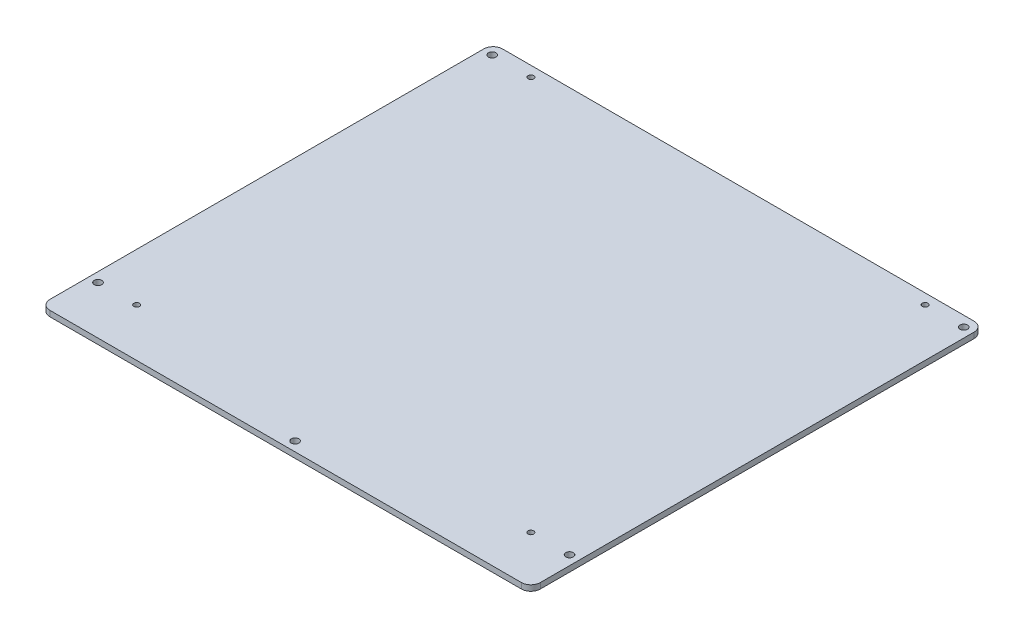
ISO-10303-21;
HEADER;
FILE_DESCRIPTION(('STEP AP214'),'2;1');
FILE_NAME('part.step','',(''),(''),'','','');
FILE_SCHEMA(('AUTOMOTIVE_DESIGN { 1 0 10303 214 1 1 1 1 }'));
ENDSEC;
DATA;
#1=APPLICATION_CONTEXT('core data for automotive mechanical design processes');
#2=APPLICATION_PROTOCOL_DEFINITION('international standard','automotive_design',2000,#1);
#3=PRODUCT_CONTEXT('',#1,'mechanical');
#4=PRODUCT('Part','Part','',(#3));
#5=PRODUCT_RELATED_PRODUCT_CATEGORY('part','',(#4));
#6=PRODUCT_DEFINITION_FORMATION('','',#4);
#7=PRODUCT_DEFINITION_CONTEXT('part definition',#1,'design');
#8=PRODUCT_DEFINITION('design','',#6,#7);
#9=PRODUCT_DEFINITION_SHAPE('','',#8);
#10=(LENGTH_UNIT() NAMED_UNIT(*) SI_UNIT(.MILLI.,.METRE.));
#11=(NAMED_UNIT(*) PLANE_ANGLE_UNIT() SI_UNIT($,.RADIAN.));
#12=(NAMED_UNIT(*) SI_UNIT($,.STERADIAN.) SOLID_ANGLE_UNIT());
#13=UNCERTAINTY_MEASURE_WITH_UNIT(LENGTH_MEASURE(1.E-05),#10,'distance_accuracy_value','');
#14=(GEOMETRIC_REPRESENTATION_CONTEXT(3) GLOBAL_UNCERTAINTY_ASSIGNED_CONTEXT((#13)) GLOBAL_UNIT_ASSIGNED_CONTEXT((#10,
#11,#12)) REPRESENTATION_CONTEXT('',''));
#15=CARTESIAN_POINT('',(0.,0.,0.));
#16=DIRECTION('',(0.,0.,1.));
#17=DIRECTION('',(1.,0.,0.));
#18=AXIS2_PLACEMENT_3D('',#15,#16,#17);
#19=CARTESIAN_POINT('',(0.,3.,0.));
#20=DIRECTION('',(0.,1.,0.));
#21=DIRECTION('',(0.,0.,1.));
#22=AXIS2_PLACEMENT_3D('',#19,#20,#21);
#23=PLANE('',#22);
#24=CARTESIAN_POINT('',(-125.,3.,-104.5));
#25=DIRECTION('',(0.,1.,0.));
#26=DIRECTION('',(0.,0.,1.));
#27=AXIS2_PLACEMENT_3D('',#24,#25,#26);
#28=CIRCLE('',#27,2.);
#29=CARTESIAN_POINT('',(-125.,3.,-102.5));
#30=VERTEX_POINT('',#29);
#31=EDGE_CURVE('E215',#30,#30,#28,.T.);
#32=ORIENTED_EDGE('',*,*,#31,.F.);
#33=EDGE_LOOP('',(#32));
#34=FACE_BOUND('',#33,.T.);
#35=CARTESIAN_POINT('',(125.,3.,104.5));
#36=DIRECTION('',(0.,1.,0.));
#37=DIRECTION('',(0.,0.,1.));
#38=AXIS2_PLACEMENT_3D('',#35,#36,#37);
#39=CIRCLE('',#38,2.);
#40=CARTESIAN_POINT('',(125.,3.,106.5));
#41=VERTEX_POINT('',#40);
#42=EDGE_CURVE('E203',#41,#41,#39,.T.);
#43=ORIENTED_EDGE('',*,*,#42,.F.);
#44=EDGE_LOOP('',(#43));
#45=FACE_BOUND('',#44,.T.);
#46=CARTESIAN_POINT('',(104.5,3.,104.5));
#47=DIRECTION('',(0.,1.,0.));
#48=DIRECTION('',(0.,0.,1.));
#49=AXIS2_PLACEMENT_3D('',#46,#47,#48);
#50=CIRCLE('',#49,1.5);
#51=CARTESIAN_POINT('',(104.5,3.,106.));
#52=VERTEX_POINT('',#51);
#53=EDGE_CURVE('E191',#52,#52,#50,.T.);
#54=ORIENTED_EDGE('',*,*,#53,.F.);
#55=EDGE_LOOP('',(#54));
#56=FACE_BOUND('',#55,.T.);
#57=CARTESIAN_POINT('',(104.5,3.,-104.5));
#58=DIRECTION('',(0.,1.,0.));
#59=DIRECTION('',(0.,0.,1.));
#60=AXIS2_PLACEMENT_3D('',#57,#58,#59);
#61=CIRCLE('',#60,1.5);
#62=CARTESIAN_POINT('',(104.5,3.,-103.));
#63=VERTEX_POINT('',#62);
#64=EDGE_CURVE('E179',#63,#63,#61,.T.);
#65=ORIENTED_EDGE('',*,*,#64,.F.);
#66=EDGE_LOOP('',(#65));
#67=FACE_BOUND('',#66,.T.);
#68=DIRECTION('',(0.,0.,1.));
#69=VECTOR('',#68,1.);
#70=CARTESIAN_POINT('',(-130.,3.,-110.));
#71=LINE('',#70,#69);
#72=CARTESIAN_POINT('',(-130.,3.,-105.));
#73=VERTEX_POINT('',#72);
#74=CARTESIAN_POINT('',(-130.,3.,125.));
#75=VERTEX_POINT('',#74);
#76=EDGE_CURVE('E136',#73,#75,#71,.T.);
#77=ORIENTED_EDGE('',*,*,#76,.T.);
#78=CARTESIAN_POINT('',(-125.,3.,125.));
#79=DIRECTION('',(0.,1.,0.));
#80=DIRECTION('',(0.,0.,1.));
#81=AXIS2_PLACEMENT_3D('',#78,#79,#80);
#82=CIRCLE('',#81,5.);
#83=CARTESIAN_POINT('',(-125.,3.,130.));
#84=VERTEX_POINT('',#83);
#85=EDGE_CURVE('E151',#75,#84,#82,.T.);
#86=ORIENTED_EDGE('',*,*,#85,.T.);
#87=DIRECTION('',(1.,0.,0.));
#88=VECTOR('',#87,1.);
#89=CARTESIAN_POINT('',(-130.,3.,130.));
#90=LINE('',#89,#88);
#91=CARTESIAN_POINT('',(125.,3.,130.));
#92=VERTEX_POINT('',#91);
#93=EDGE_CURVE('E118',#84,#92,#90,.T.);
#94=ORIENTED_EDGE('',*,*,#93,.T.);
#95=CARTESIAN_POINT('',(125.,3.,125.));
#96=DIRECTION('',(0.,1.,0.));
#97=DIRECTION('',(0.,0.,1.));
#98=AXIS2_PLACEMENT_3D('',#95,#96,#97);
#99=CIRCLE('',#98,5.);
#100=CARTESIAN_POINT('',(130.,3.,125.));
#101=VERTEX_POINT('',#100);
#102=EDGE_CURVE('E149',#92,#101,#99,.T.);
#103=ORIENTED_EDGE('',*,*,#102,.T.);
#104=DIRECTION('',(0.,0.,-1.));
#105=VECTOR('',#104,1.);
#106=CARTESIAN_POINT('',(130.,3.,-110.));
#107=LINE('',#106,#105);
#108=CARTESIAN_POINT('',(130.,3.,-105.));
#109=VERTEX_POINT('',#108);
#110=EDGE_CURVE('E162',#101,#109,#107,.T.);
#111=ORIENTED_EDGE('',*,*,#110,.T.);
#112=CARTESIAN_POINT('',(125.,3.,-105.));
#113=DIRECTION('',(0.,1.,0.));
#114=DIRECTION('',(0.,0.,1.));
#115=AXIS2_PLACEMENT_3D('',#112,#113,#114);
#116=CIRCLE('',#115,5.);
#117=CARTESIAN_POINT('',(125.,3.,-110.));
#118=VERTEX_POINT('',#117);
#119=EDGE_CURVE('E53',#109,#118,#116,.T.);
#120=ORIENTED_EDGE('',*,*,#119,.T.);
#121=DIRECTION('',(-1.,0.,0.));
#122=VECTOR('',#121,1.);
#123=CARTESIAN_POINT('',(-130.,3.,-110.));
#124=LINE('',#123,#122);
#125=CARTESIAN_POINT('',(-125.,3.,-110.));
#126=VERTEX_POINT('',#125);
#127=EDGE_CURVE('E137',#118,#126,#124,.T.);
#128=ORIENTED_EDGE('',*,*,#127,.T.);
#129=CARTESIAN_POINT('',(-125.,3.,-105.));
#130=DIRECTION('',(0.,1.,0.));
#131=DIRECTION('',(0.,0.,1.));
#132=AXIS2_PLACEMENT_3D('',#129,#130,#131);
#133=CIRCLE('',#132,5.);
#134=EDGE_CURVE('E146',#126,#73,#133,.T.);
#135=ORIENTED_EDGE('',*,*,#134,.T.);
#136=EDGE_LOOP('',(#77,#86,#94,#103,#111,#120,#128,#135));
#137=FACE_BOUND('',#136,.T.);
#138=CARTESIAN_POINT('',(-104.5,3.,-104.5));
#139=DIRECTION('',(0.,1.,0.));
#140=DIRECTION('',(0.,0.,1.));
#141=AXIS2_PLACEMENT_3D('',#138,#139,#140);
#142=CIRCLE('',#141,1.5);
#143=CARTESIAN_POINT('',(-104.5,3.,-103.));
#144=VERTEX_POINT('',#143);
#145=EDGE_CURVE('E131',#144,#144,#142,.T.);
#146=ORIENTED_EDGE('',*,*,#145,.F.);
#147=EDGE_LOOP('',(#146));
#148=FACE_BOUND('',#147,.T.);
#149=CARTESIAN_POINT('',(-104.5,3.,104.5));
#150=DIRECTION('',(0.,1.,0.));
#151=DIRECTION('',(0.,0.,1.));
#152=AXIS2_PLACEMENT_3D('',#149,#150,#151);
#153=CIRCLE('',#152,1.5);
#154=CARTESIAN_POINT('',(-104.5,3.,106.));
#155=VERTEX_POINT('',#154);
#156=EDGE_CURVE('E185',#155,#155,#153,.T.);
#157=ORIENTED_EDGE('',*,*,#156,.F.);
#158=EDGE_LOOP('',(#157));
#159=FACE_BOUND('',#158,.T.);
#160=CARTESIAN_POINT('',(125.,3.,-104.5));
#161=DIRECTION('',(0.,1.,0.));
#162=DIRECTION('',(0.,0.,1.));
#163=AXIS2_PLACEMENT_3D('',#160,#161,#162);
#164=CIRCLE('',#163,2.);
#165=CARTESIAN_POINT('',(125.,3.,-102.5));
#166=VERTEX_POINT('',#165);
#167=EDGE_CURVE('E197',#166,#166,#164,.T.);
#168=ORIENTED_EDGE('',*,*,#167,.F.);
#169=EDGE_LOOP('',(#168));
#170=FACE_BOUND('',#169,.T.);
#171=CARTESIAN_POINT('',(-125.,3.,104.5));
#172=DIRECTION('',(0.,1.,0.));
#173=DIRECTION('',(0.,0.,1.));
#174=AXIS2_PLACEMENT_3D('',#171,#172,#173);
#175=CIRCLE('',#174,2.);
#176=CARTESIAN_POINT('',(-125.,3.,106.5));
#177=VERTEX_POINT('',#176);
#178=EDGE_CURVE('E209',#177,#177,#175,.T.);
#179=ORIENTED_EDGE('',*,*,#178,.F.);
#180=EDGE_LOOP('',(#179));
#181=FACE_BOUND('',#180,.T.);
#182=CARTESIAN_POINT('',(0.,3.,125.));
#183=DIRECTION('',(0.,1.,0.));
#184=DIRECTION('',(0.,0.,1.));
#185=AXIS2_PLACEMENT_3D('',#182,#183,#184);
#186=CIRCLE('',#185,2.);
#187=CARTESIAN_POINT('',(0.,3.,127.));
#188=VERTEX_POINT('',#187);
#189=EDGE_CURVE('E221',#188,#188,#186,.T.);
#190=ORIENTED_EDGE('',*,*,#189,.F.);
#191=EDGE_LOOP('',(#190));
#192=FACE_BOUND('',#191,.T.);
#193=ADVANCED_FACE('F32',(#34,#45,#56,#67,#137,#148,#159,#170,#181,#192),#23,.T.);
#194=CARTESIAN_POINT('',(0.,0.,0.));
#195=DIRECTION('',(0.,1.,0.));
#196=DIRECTION('',(0.,0.,1.));
#197=AXIS2_PLACEMENT_3D('',#194,#195,#196);
#198=PLANE('',#197);
#199=CARTESIAN_POINT('',(-125.,0.,-104.5));
#200=DIRECTION('',(0.,1.,0.));
#201=DIRECTION('',(0.,0.,1.));
#202=AXIS2_PLACEMENT_3D('',#199,#200,#201);
#203=CIRCLE('',#202,2.);
#204=CARTESIAN_POINT('',(-125.,0.,-102.5));
#205=VERTEX_POINT('',#204);
#206=EDGE_CURVE('E218',#205,#205,#203,.T.);
#207=ORIENTED_EDGE('',*,*,#206,.T.);
#208=EDGE_LOOP('',(#207));
#209=FACE_BOUND('',#208,.T.);
#210=CARTESIAN_POINT('',(125.,0.,104.5));
#211=DIRECTION('',(0.,1.,0.));
#212=DIRECTION('',(0.,0.,1.));
#213=AXIS2_PLACEMENT_3D('',#210,#211,#212);
#214=CIRCLE('',#213,2.);
#215=CARTESIAN_POINT('',(125.,0.,106.5));
#216=VERTEX_POINT('',#215);
#217=EDGE_CURVE('E206',#216,#216,#214,.T.);
#218=ORIENTED_EDGE('',*,*,#217,.T.);
#219=EDGE_LOOP('',(#218));
#220=FACE_BOUND('',#219,.T.);
#221=CARTESIAN_POINT('',(104.5,0.,104.5));
#222=DIRECTION('',(0.,1.,0.));
#223=DIRECTION('',(0.,0.,1.));
#224=AXIS2_PLACEMENT_3D('',#221,#222,#223);
#225=CIRCLE('',#224,1.5);
#226=CARTESIAN_POINT('',(104.5,0.,106.));
#227=VERTEX_POINT('',#226);
#228=EDGE_CURVE('E194',#227,#227,#225,.T.);
#229=ORIENTED_EDGE('',*,*,#228,.T.);
#230=EDGE_LOOP('',(#229));
#231=FACE_BOUND('',#230,.T.);
#232=CARTESIAN_POINT('',(104.5,0.,-104.5));
#233=DIRECTION('',(0.,1.,0.));
#234=DIRECTION('',(0.,0.,1.));
#235=AXIS2_PLACEMENT_3D('',#232,#233,#234);
#236=CIRCLE('',#235,1.5);
#237=CARTESIAN_POINT('',(104.5,0.,-103.));
#238=VERTEX_POINT('',#237);
#239=EDGE_CURVE('E182',#238,#238,#236,.T.);
#240=ORIENTED_EDGE('',*,*,#239,.T.);
#241=EDGE_LOOP('',(#240));
#242=FACE_BOUND('',#241,.T.);
#243=DIRECTION('',(1.,0.,0.));
#244=VECTOR('',#243,1.);
#245=CARTESIAN_POINT('',(-130.,0.,130.));
#246=LINE('',#245,#244);
#247=CARTESIAN_POINT('',(-125.,0.,130.));
#248=VERTEX_POINT('',#247);
#249=CARTESIAN_POINT('',(125.,0.,130.));
#250=VERTEX_POINT('',#249);
#251=EDGE_CURVE('E115',#248,#250,#246,.T.);
#252=ORIENTED_EDGE('',*,*,#251,.F.);
#253=CARTESIAN_POINT('',(-125.,0.,125.));
#254=DIRECTION('',(0.,1.,0.));
#255=DIRECTION('',(0.,0.,1.));
#256=AXIS2_PLACEMENT_3D('',#253,#254,#255);
#257=CIRCLE('',#256,5.);
#258=CARTESIAN_POINT('',(-130.,0.,125.));
#259=VERTEX_POINT('',#258);
#260=EDGE_CURVE('E98',#248,#259,#257,.F.);
#261=ORIENTED_EDGE('',*,*,#260,.T.);
#262=DIRECTION('',(0.,0.,1.));
#263=VECTOR('',#262,1.);
#264=CARTESIAN_POINT('',(-130.,0.,-110.));
#265=LINE('',#264,#263);
#266=CARTESIAN_POINT('',(-130.,0.,-105.));
#267=VERTEX_POINT('',#266);
#268=EDGE_CURVE('E126',#267,#259,#265,.T.);
#269=ORIENTED_EDGE('',*,*,#268,.F.);
#270=CARTESIAN_POINT('',(-125.,0.,-105.));
#271=DIRECTION('',(0.,1.,0.));
#272=DIRECTION('',(0.,0.,1.));
#273=AXIS2_PLACEMENT_3D('',#270,#271,#272);
#274=CIRCLE('',#273,5.);
#275=CARTESIAN_POINT('',(-125.,0.,-110.));
#276=VERTEX_POINT('',#275);
#277=EDGE_CURVE('E119',#267,#276,#274,.F.);
#278=ORIENTED_EDGE('',*,*,#277,.T.);
#279=DIRECTION('',(-1.,0.,0.));
#280=VECTOR('',#279,1.);
#281=CARTESIAN_POINT('',(-130.,0.,-110.));
#282=LINE('',#281,#280);
#283=CARTESIAN_POINT('',(125.,0.,-110.));
#284=VERTEX_POINT('',#283);
#285=EDGE_CURVE('E129',#284,#276,#282,.T.);
#286=ORIENTED_EDGE('',*,*,#285,.F.);
#287=CARTESIAN_POINT('',(125.,0.,-105.));
#288=DIRECTION('',(0.,1.,0.));
#289=DIRECTION('',(0.,0.,1.));
#290=AXIS2_PLACEMENT_3D('',#287,#288,#289);
#291=CIRCLE('',#290,5.);
#292=CARTESIAN_POINT('',(130.,0.,-105.));
#293=VERTEX_POINT('',#292);
#294=EDGE_CURVE('E140',#284,#293,#291,.F.);
#295=ORIENTED_EDGE('',*,*,#294,.T.);
#296=DIRECTION('',(0.,0.,-1.));
#297=VECTOR('',#296,1.);
#298=CARTESIAN_POINT('',(130.,0.,-110.));
#299=LINE('',#298,#297);
#300=CARTESIAN_POINT('',(130.,0.,125.));
#301=VERTEX_POINT('',#300);
#302=EDGE_CURVE('E125',#301,#293,#299,.T.);
#303=ORIENTED_EDGE('',*,*,#302,.F.);
#304=CARTESIAN_POINT('',(125.,0.,125.));
#305=DIRECTION('',(0.,1.,0.));
#306=DIRECTION('',(0.,0.,1.));
#307=AXIS2_PLACEMENT_3D('',#304,#305,#306);
#308=CIRCLE('',#307,5.);
#309=EDGE_CURVE('E109',#301,#250,#308,.F.);
#310=ORIENTED_EDGE('',*,*,#309,.T.);
#311=EDGE_LOOP('',(#252,#261,#269,#278,#286,#295,#303,#310));
#312=FACE_BOUND('',#311,.T.);
#313=CARTESIAN_POINT('',(-104.5,0.,-104.5));
#314=DIRECTION('',(0.,1.,0.));
#315=DIRECTION('',(0.,0.,1.));
#316=AXIS2_PLACEMENT_3D('',#313,#314,#315);
#317=CIRCLE('',#316,1.5);
#318=CARTESIAN_POINT('',(-104.5,0.,-103.));
#319=VERTEX_POINT('',#318);
#320=EDGE_CURVE('E176',#319,#319,#317,.T.);
#321=ORIENTED_EDGE('',*,*,#320,.T.);
#322=EDGE_LOOP('',(#321));
#323=FACE_BOUND('',#322,.T.);
#324=CARTESIAN_POINT('',(-104.5,0.,104.5));
#325=DIRECTION('',(0.,1.,0.));
#326=DIRECTION('',(0.,0.,1.));
#327=AXIS2_PLACEMENT_3D('',#324,#325,#326);
#328=CIRCLE('',#327,1.5);
#329=CARTESIAN_POINT('',(-104.5,0.,106.));
#330=VERTEX_POINT('',#329);
#331=EDGE_CURVE('E188',#330,#330,#328,.T.);
#332=ORIENTED_EDGE('',*,*,#331,.T.);
#333=EDGE_LOOP('',(#332));
#334=FACE_BOUND('',#333,.T.);
#335=CARTESIAN_POINT('',(125.,0.,-104.5));
#336=DIRECTION('',(0.,1.,0.));
#337=DIRECTION('',(0.,0.,1.));
#338=AXIS2_PLACEMENT_3D('',#335,#336,#337);
#339=CIRCLE('',#338,2.);
#340=CARTESIAN_POINT('',(125.,0.,-102.5));
#341=VERTEX_POINT('',#340);
#342=EDGE_CURVE('E200',#341,#341,#339,.T.);
#343=ORIENTED_EDGE('',*,*,#342,.T.);
#344=EDGE_LOOP('',(#343));
#345=FACE_BOUND('',#344,.T.);
#346=CARTESIAN_POINT('',(-125.,0.,104.5));
#347=DIRECTION('',(0.,1.,0.));
#348=DIRECTION('',(0.,0.,1.));
#349=AXIS2_PLACEMENT_3D('',#346,#347,#348);
#350=CIRCLE('',#349,2.);
#351=CARTESIAN_POINT('',(-125.,0.,106.5));
#352=VERTEX_POINT('',#351);
#353=EDGE_CURVE('E212',#352,#352,#350,.T.);
#354=ORIENTED_EDGE('',*,*,#353,.T.);
#355=EDGE_LOOP('',(#354));
#356=FACE_BOUND('',#355,.T.);
#357=CARTESIAN_POINT('',(0.,0.,125.));
#358=DIRECTION('',(0.,1.,0.));
#359=DIRECTION('',(0.,0.,1.));
#360=AXIS2_PLACEMENT_3D('',#357,#358,#359);
#361=CIRCLE('',#360,2.);
#362=CARTESIAN_POINT('',(0.,0.,127.));
#363=VERTEX_POINT('',#362);
#364=EDGE_CURVE('E224',#363,#363,#361,.T.);
#365=ORIENTED_EDGE('',*,*,#364,.T.);
#366=EDGE_LOOP('',(#365));
#367=FACE_BOUND('',#366,.T.);
#368=ADVANCED_FACE('F122',(#209,#220,#231,#242,#312,#323,#334,#345,#356,#367),#198,.F.);
#369=CARTESIAN_POINT('',(-130.,3.,-110.));
#370=DIRECTION('',(1.,0.,0.));
#371=DIRECTION('',(0.,0.,-1.));
#372=AXIS2_PLACEMENT_3D('',#369,#370,#371);
#373=PLANE('',#372);
#374=ORIENTED_EDGE('',*,*,#268,.T.);
#375=DIRECTION('',(0.,-1.,0.));
#376=VECTOR('',#375,1.);
#377=CARTESIAN_POINT('',(-130.,3.,125.));
#378=LINE('',#377,#376);
#379=EDGE_CURVE('E103',#259,#75,#378,.F.);
#380=ORIENTED_EDGE('',*,*,#379,.T.);
#381=ORIENTED_EDGE('',*,*,#76,.F.);
#382=DIRECTION('',(0.,-1.,0.));
#383=VECTOR('',#382,1.);
#384=CARTESIAN_POINT('',(-130.,3.,-105.));
#385=LINE('',#384,#383);
#386=EDGE_CURVE('E108',#73,#267,#385,.T.);
#387=ORIENTED_EDGE('',*,*,#386,.T.);
#388=EDGE_LOOP('',(#374,#380,#381,#387));
#389=FACE_BOUND('',#388,.T.);
#390=ADVANCED_FACE('F239',(#389),#373,.F.);
#391=CARTESIAN_POINT('',(-130.,3.,130.));
#392=DIRECTION('',(0.,0.,-1.));
#393=DIRECTION('',(-1.,0.,0.));
#394=AXIS2_PLACEMENT_3D('',#391,#392,#393);
#395=PLANE('',#394);
#396=ORIENTED_EDGE('',*,*,#93,.F.);
#397=DIRECTION('',(0.,-1.,0.));
#398=VECTOR('',#397,1.);
#399=CARTESIAN_POINT('',(-125.,3.,130.));
#400=LINE('',#399,#398);
#401=EDGE_CURVE('E102',#84,#248,#400,.T.);
#402=ORIENTED_EDGE('',*,*,#401,.T.);
#403=ORIENTED_EDGE('',*,*,#251,.T.);
#404=DIRECTION('',(0.,-1.,0.));
#405=VECTOR('',#404,1.);
#406=CARTESIAN_POINT('',(125.,3.,130.));
#407=LINE('',#406,#405);
#408=EDGE_CURVE('E120',#250,#92,#407,.F.);
#409=ORIENTED_EDGE('',*,*,#408,.T.);
#410=EDGE_LOOP('',(#396,#402,#403,#409));
#411=FACE_BOUND('',#410,.T.);
#412=ADVANCED_FACE('F114',(#411),#395,.F.);
#413=CARTESIAN_POINT('',(130.,3.,-110.));
#414=DIRECTION('',(-1.,0.,0.));
#415=DIRECTION('',(0.,0.,1.));
#416=AXIS2_PLACEMENT_3D('',#413,#414,#415);
#417=PLANE('',#416);
#418=ORIENTED_EDGE('',*,*,#110,.F.);
#419=DIRECTION('',(0.,-1.,0.));
#420=VECTOR('',#419,1.);
#421=CARTESIAN_POINT('',(130.,3.,125.));
#422=LINE('',#421,#420);
#423=EDGE_CURVE('E155',#101,#301,#422,.T.);
#424=ORIENTED_EDGE('',*,*,#423,.T.);
#425=ORIENTED_EDGE('',*,*,#302,.T.);
#426=DIRECTION('',(0.,-1.,0.));
#427=VECTOR('',#426,1.);
#428=CARTESIAN_POINT('',(130.,3.,-105.));
#429=LINE('',#428,#427);
#430=EDGE_CURVE('E153',#293,#109,#429,.F.);
#431=ORIENTED_EDGE('',*,*,#430,.T.);
#432=EDGE_LOOP('',(#418,#424,#425,#431));
#433=FACE_BOUND('',#432,.T.);
#434=ADVANCED_FACE('F160',(#433),#417,.F.);
#435=CARTESIAN_POINT('',(-130.,3.,-110.));
#436=DIRECTION('',(0.,0.,1.));
#437=DIRECTION('',(1.,0.,0.));
#438=AXIS2_PLACEMENT_3D('',#435,#436,#437);
#439=PLANE('',#438);
#440=ORIENTED_EDGE('',*,*,#127,.F.);
#441=DIRECTION('',(0.,-1.,0.));
#442=VECTOR('',#441,1.);
#443=CARTESIAN_POINT('',(125.,3.,-110.));
#444=LINE('',#443,#442);
#445=EDGE_CURVE('E11',#118,#284,#444,.T.);
#446=ORIENTED_EDGE('',*,*,#445,.T.);
#447=ORIENTED_EDGE('',*,*,#285,.T.);
#448=DIRECTION('',(0.,-1.,0.));
#449=VECTOR('',#448,1.);
#450=CARTESIAN_POINT('',(-125.,3.,-110.));
#451=LINE('',#450,#449);
#452=EDGE_CURVE('E40',#276,#126,#451,.F.);
#453=ORIENTED_EDGE('',*,*,#452,.T.);
#454=EDGE_LOOP('',(#440,#446,#447,#453));
#455=FACE_BOUND('',#454,.T.);
#456=ADVANCED_FACE('F169',(#455),#439,.F.);
#457=CARTESIAN_POINT('',(-104.5,3.,-104.5));
#458=DIRECTION('',(0.,-1.,0.));
#459=DIRECTION('',(0.,0.,-1.));
#460=AXIS2_PLACEMENT_3D('',#457,#458,#459);
#461=CYLINDRICAL_SURFACE('',#460,1.5);
#462=ORIENTED_EDGE('',*,*,#145,.T.);
#463=EDGE_LOOP('',(#462));
#464=FACE_BOUND('',#463,.T.);
#465=ORIENTED_EDGE('',*,*,#320,.F.);
#466=EDGE_LOOP('',(#465));
#467=FACE_BOUND('',#466,.T.);
#468=ADVANCED_FACE('F245',(#464,#467),#461,.F.);
#469=CARTESIAN_POINT('',(104.5,3.,-104.5));
#470=DIRECTION('',(0.,-1.,0.));
#471=DIRECTION('',(0.,0.,-1.));
#472=AXIS2_PLACEMENT_3D('',#469,#470,#471);
#473=CYLINDRICAL_SURFACE('',#472,1.5);
#474=ORIENTED_EDGE('',*,*,#64,.T.);
#475=EDGE_LOOP('',(#474));
#476=FACE_BOUND('',#475,.T.);
#477=ORIENTED_EDGE('',*,*,#239,.F.);
#478=EDGE_LOOP('',(#477));
#479=FACE_BOUND('',#478,.T.);
#480=ADVANCED_FACE('F310',(#476,#479),#473,.F.);
#481=CARTESIAN_POINT('',(-104.5,3.,104.5));
#482=DIRECTION('',(0.,-1.,0.));
#483=DIRECTION('',(0.,0.,-1.));
#484=AXIS2_PLACEMENT_3D('',#481,#482,#483);
#485=CYLINDRICAL_SURFACE('',#484,1.5);
#486=ORIENTED_EDGE('',*,*,#156,.T.);
#487=EDGE_LOOP('',(#486));
#488=FACE_BOUND('',#487,.T.);
#489=ORIENTED_EDGE('',*,*,#331,.F.);
#490=EDGE_LOOP('',(#489));
#491=FACE_BOUND('',#490,.T.);
#492=ADVANCED_FACE('F307',(#488,#491),#485,.F.);
#493=CARTESIAN_POINT('',(104.5,3.,104.5));
#494=DIRECTION('',(0.,-1.,0.));
#495=DIRECTION('',(0.,0.,-1.));
#496=AXIS2_PLACEMENT_3D('',#493,#494,#495);
#497=CYLINDRICAL_SURFACE('',#496,1.5);
#498=ORIENTED_EDGE('',*,*,#53,.T.);
#499=EDGE_LOOP('',(#498));
#500=FACE_BOUND('',#499,.T.);
#501=ORIENTED_EDGE('',*,*,#228,.F.);
#502=EDGE_LOOP('',(#501));
#503=FACE_BOUND('',#502,.T.);
#504=ADVANCED_FACE('F303',(#500,#503),#497,.F.);
#505=CARTESIAN_POINT('',(125.,3.,-104.5));
#506=DIRECTION('',(0.,-1.,0.));
#507=DIRECTION('',(0.,0.,-1.));
#508=AXIS2_PLACEMENT_3D('',#505,#506,#507);
#509=CYLINDRICAL_SURFACE('',#508,2.);
#510=ORIENTED_EDGE('',*,*,#167,.T.);
#511=EDGE_LOOP('',(#510));
#512=FACE_BOUND('',#511,.T.);
#513=ORIENTED_EDGE('',*,*,#342,.F.);
#514=EDGE_LOOP('',(#513));
#515=FACE_BOUND('',#514,.T.);
#516=ADVANCED_FACE('F299',(#512,#515),#509,.F.);
#517=CARTESIAN_POINT('',(125.,3.,104.5));
#518=DIRECTION('',(0.,-1.,0.));
#519=DIRECTION('',(0.,0.,-1.));
#520=AXIS2_PLACEMENT_3D('',#517,#518,#519);
#521=CYLINDRICAL_SURFACE('',#520,2.);
#522=ORIENTED_EDGE('',*,*,#42,.T.);
#523=EDGE_LOOP('',(#522));
#524=FACE_BOUND('',#523,.T.);
#525=ORIENTED_EDGE('',*,*,#217,.F.);
#526=EDGE_LOOP('',(#525));
#527=FACE_BOUND('',#526,.T.);
#528=ADVANCED_FACE('F283',(#524,#527),#521,.F.);
#529=CARTESIAN_POINT('',(-125.,3.,104.5));
#530=DIRECTION('',(0.,-1.,0.));
#531=DIRECTION('',(0.,0.,-1.));
#532=AXIS2_PLACEMENT_3D('',#529,#530,#531);
#533=CYLINDRICAL_SURFACE('',#532,2.);
#534=ORIENTED_EDGE('',*,*,#178,.T.);
#535=EDGE_LOOP('',(#534));
#536=FACE_BOUND('',#535,.T.);
#537=ORIENTED_EDGE('',*,*,#353,.F.);
#538=EDGE_LOOP('',(#537));
#539=FACE_BOUND('',#538,.T.);
#540=ADVANCED_FACE('F279',(#536,#539),#533,.F.);
#541=CARTESIAN_POINT('',(-125.,3.,-104.5));
#542=DIRECTION('',(0.,-1.,0.));
#543=DIRECTION('',(0.,0.,-1.));
#544=AXIS2_PLACEMENT_3D('',#541,#542,#543);
#545=CYLINDRICAL_SURFACE('',#544,2.);
#546=ORIENTED_EDGE('',*,*,#31,.T.);
#547=EDGE_LOOP('',(#546));
#548=FACE_BOUND('',#547,.T.);
#549=ORIENTED_EDGE('',*,*,#206,.F.);
#550=EDGE_LOOP('',(#549));
#551=FACE_BOUND('',#550,.T.);
#552=ADVANCED_FACE('F282',(#548,#551),#545,.F.);
#553=CARTESIAN_POINT('',(0.,3.,125.));
#554=DIRECTION('',(0.,-1.,0.));
#555=DIRECTION('',(0.,0.,-1.));
#556=AXIS2_PLACEMENT_3D('',#553,#554,#555);
#557=CYLINDRICAL_SURFACE('',#556,2.);
#558=ORIENTED_EDGE('',*,*,#189,.T.);
#559=EDGE_LOOP('',(#558));
#560=FACE_BOUND('',#559,.T.);
#561=ORIENTED_EDGE('',*,*,#364,.F.);
#562=EDGE_LOOP('',(#561));
#563=FACE_BOUND('',#562,.T.);
#564=ADVANCED_FACE('F230',(#560,#563),#557,.F.);
#565=CARTESIAN_POINT('',(-125.,3.,125.));
#566=DIRECTION('',(0.,-1.,0.));
#567=DIRECTION('',(0.,0.,-1.));
#568=AXIS2_PLACEMENT_3D('',#565,#566,#567);
#569=CYLINDRICAL_SURFACE('',#568,5.);
#570=ORIENTED_EDGE('',*,*,#85,.F.);
#571=ORIENTED_EDGE('',*,*,#379,.F.);
#572=ORIENTED_EDGE('',*,*,#260,.F.);
#573=ORIENTED_EDGE('',*,*,#401,.F.);
#574=EDGE_LOOP('',(#570,#571,#572,#573));
#575=FACE_BOUND('',#574,.T.);
#576=ADVANCED_FACE('F101',(#575),#569,.T.);
#577=CARTESIAN_POINT('',(125.,3.,125.));
#578=DIRECTION('',(0.,-1.,0.));
#579=DIRECTION('',(0.,0.,-1.));
#580=AXIS2_PLACEMENT_3D('',#577,#578,#579);
#581=CYLINDRICAL_SURFACE('',#580,5.);
#582=ORIENTED_EDGE('',*,*,#102,.F.);
#583=ORIENTED_EDGE('',*,*,#408,.F.);
#584=ORIENTED_EDGE('',*,*,#309,.F.);
#585=ORIENTED_EDGE('',*,*,#423,.F.);
#586=EDGE_LOOP('',(#582,#583,#584,#585));
#587=FACE_BOUND('',#586,.T.);
#588=ADVANCED_FACE('F259',(#587),#581,.T.);
#589=CARTESIAN_POINT('',(125.,3.,-105.));
#590=DIRECTION('',(0.,-1.,0.));
#591=DIRECTION('',(0.,0.,-1.));
#592=AXIS2_PLACEMENT_3D('',#589,#590,#591);
#593=CYLINDRICAL_SURFACE('',#592,5.);
#594=ORIENTED_EDGE('',*,*,#119,.F.);
#595=ORIENTED_EDGE('',*,*,#430,.F.);
#596=ORIENTED_EDGE('',*,*,#294,.F.);
#597=ORIENTED_EDGE('',*,*,#445,.F.);
#598=EDGE_LOOP('',(#594,#595,#596,#597));
#599=FACE_BOUND('',#598,.T.);
#600=ADVANCED_FACE('F168',(#599),#593,.T.);
#601=CARTESIAN_POINT('',(-125.,3.,-105.));
#602=DIRECTION('',(0.,-1.,0.));
#603=DIRECTION('',(0.,0.,-1.));
#604=AXIS2_PLACEMENT_3D('',#601,#602,#603);
#605=CYLINDRICAL_SURFACE('',#604,5.);
#606=ORIENTED_EDGE('',*,*,#134,.F.);
#607=ORIENTED_EDGE('',*,*,#452,.F.);
#608=ORIENTED_EDGE('',*,*,#277,.F.);
#609=ORIENTED_EDGE('',*,*,#386,.F.);
#610=EDGE_LOOP('',(#606,#607,#608,#609));
#611=FACE_BOUND('',#610,.T.);
#612=ADVANCED_FACE('F34',(#611),#605,.T.);
#613=CLOSED_SHELL('',(#193,#368,#390,#412,#434,#456,#468,#480,#492,#504,#516,#528,#540,#552,
#564,#576,#588,#600,#612));
#614=MANIFOLD_SOLID_BREP('B2',#613);
#615=ADVANCED_BREP_SHAPE_REPRESENTATION('',(#18,#614),#14);
#616=SHAPE_DEFINITION_REPRESENTATION(#9,#615);
ENDSEC;
END-ISO-10303-21;
